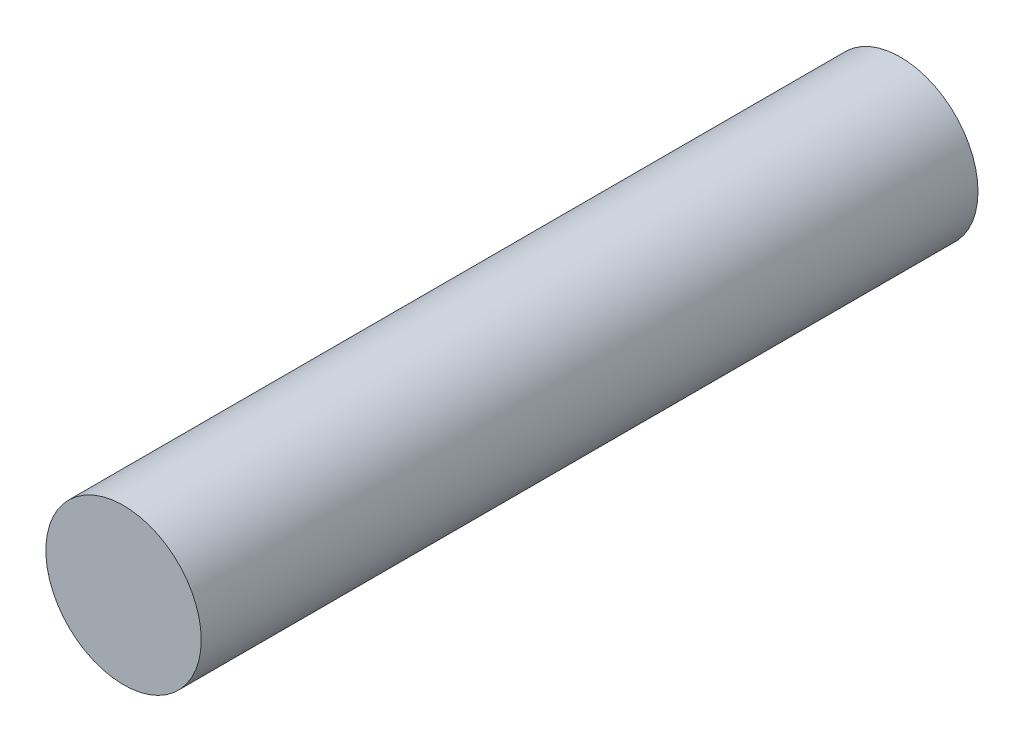
ISO-10303-21;
HEADER;
FILE_DESCRIPTION(('STEP AP214'),'2;1');
FILE_NAME('part.step','',(''),(''),'','','');
FILE_SCHEMA(('AUTOMOTIVE_DESIGN { 1 0 10303 214 1 1 1 1 }'));
ENDSEC;
DATA;
#1=APPLICATION_CONTEXT('core data for automotive mechanical design processes');
#2=APPLICATION_PROTOCOL_DEFINITION('international standard','automotive_design',2000,#1);
#3=PRODUCT_CONTEXT('',#1,'mechanical');
#4=PRODUCT('Part','Part','',(#3));
#5=PRODUCT_RELATED_PRODUCT_CATEGORY('part','',(#4));
#6=PRODUCT_DEFINITION_FORMATION('','',#4);
#7=PRODUCT_DEFINITION_CONTEXT('part definition',#1,'design');
#8=PRODUCT_DEFINITION('design','',#6,#7);
#9=PRODUCT_DEFINITION_SHAPE('','',#8);
#10=(LENGTH_UNIT() NAMED_UNIT(*) SI_UNIT(.MILLI.,.METRE.));
#11=(NAMED_UNIT(*) PLANE_ANGLE_UNIT() SI_UNIT($,.RADIAN.));
#12=(NAMED_UNIT(*) SI_UNIT($,.STERADIAN.) SOLID_ANGLE_UNIT());
#13=UNCERTAINTY_MEASURE_WITH_UNIT(LENGTH_MEASURE(1.E-05),#10,'distance_accuracy_value','');
#14=(GEOMETRIC_REPRESENTATION_CONTEXT(3) GLOBAL_UNCERTAINTY_ASSIGNED_CONTEXT((#13)) GLOBAL_UNIT_ASSIGNED_CONTEXT((#10,
#11,#12)) REPRESENTATION_CONTEXT('',''));
#15=CARTESIAN_POINT('',(0.,0.,0.));
#16=DIRECTION('',(0.,0.,1.));
#17=DIRECTION('',(1.,0.,0.));
#18=AXIS2_PLACEMENT_3D('',#15,#16,#17);
#19=CARTESIAN_POINT('',(0.,0.,15.));
#20=DIRECTION('',(0.,0.,-1.));
#21=DIRECTION('',(-1.,0.,0.));
#22=AXIS2_PLACEMENT_3D('',#19,#20,#21);
#23=CYLINDRICAL_SURFACE('',#22,1.5);
#24=CARTESIAN_POINT('',(0.,0.,15.));
#25=DIRECTION('',(0.,0.,1.));
#26=DIRECTION('',(1.,0.,0.));
#27=AXIS2_PLACEMENT_3D('',#24,#25,#26);
#28=CIRCLE('',#27,1.5);
#29=CARTESIAN_POINT('',(1.5,0.,15.));
#30=VERTEX_POINT('',#29);
#31=EDGE_CURVE('E10',#30,#30,#28,.T.);
#32=ORIENTED_EDGE('',*,*,#31,.F.);
#33=EDGE_LOOP('',(#32));
#34=FACE_BOUND('',#33,.T.);
#35=CARTESIAN_POINT('',(0.,0.,0.));
#36=DIRECTION('',(0.,0.,1.));
#37=DIRECTION('',(1.,0.,0.));
#38=AXIS2_PLACEMENT_3D('',#35,#36,#37);
#39=CIRCLE('',#38,1.5);
#40=CARTESIAN_POINT('',(1.5,0.,0.));
#41=VERTEX_POINT('',#40);
#42=EDGE_CURVE('E40',#41,#41,#39,.T.);
#43=ORIENTED_EDGE('',*,*,#42,.T.);
#44=EDGE_LOOP('',(#43));
#45=FACE_BOUND('',#44,.T.);
#46=ADVANCED_FACE('F37',(#34,#45),#23,.T.);
#47=CARTESIAN_POINT('',(0.,0.,15.));
#48=DIRECTION('',(0.,0.,1.));
#49=DIRECTION('',(1.,0.,0.));
#50=AXIS2_PLACEMENT_3D('',#47,#48,#49);
#51=PLANE('',#50);
#52=ORIENTED_EDGE('',*,*,#31,.T.);
#53=EDGE_LOOP('',(#52));
#54=FACE_BOUND('',#53,.T.);
#55=ADVANCED_FACE('F54',(#54),#51,.T.);
#56=CARTESIAN_POINT('',(0.,0.,0.));
#57=DIRECTION('',(0.,0.,1.));
#58=DIRECTION('',(1.,0.,0.));
#59=AXIS2_PLACEMENT_3D('',#56,#57,#58);
#60=PLANE('',#59);
#61=ORIENTED_EDGE('',*,*,#42,.F.);
#62=EDGE_LOOP('',(#61));
#63=FACE_BOUND('',#62,.T.);
#64=ADVANCED_FACE('F52',(#63),#60,.F.);
#65=CLOSED_SHELL('',(#46,#55,#64));
#66=MANIFOLD_SOLID_BREP('B2',#65);
#67=ADVANCED_BREP_SHAPE_REPRESENTATION('',(#18,#66),#14);
#68=SHAPE_DEFINITION_REPRESENTATION(#9,#67);
ENDSEC;
END-ISO-10303-21;
